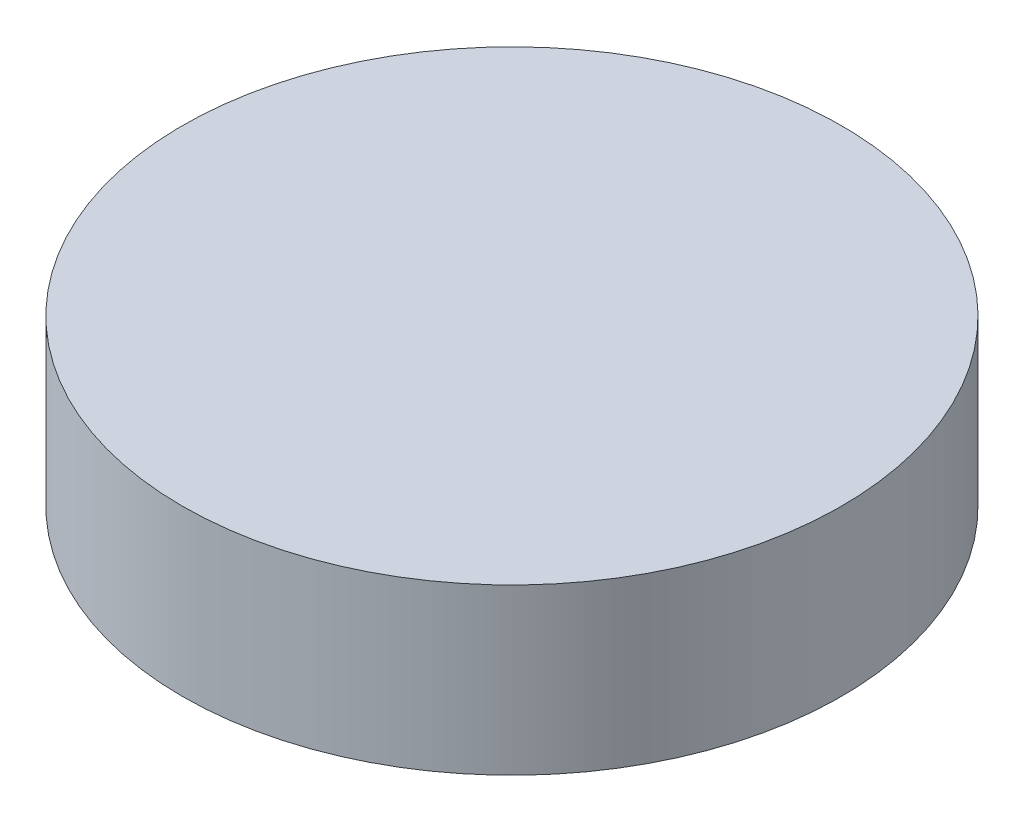
ISO-10303-21;
HEADER;
FILE_DESCRIPTION(('STEP AP214'),'2;1');
FILE_NAME('part.step','',(''),(''),'','','');
FILE_SCHEMA(('AUTOMOTIVE_DESIGN { 1 0 10303 214 1 1 1 1 }'));
ENDSEC;
DATA;
#1=APPLICATION_CONTEXT('core data for automotive mechanical design processes');
#2=APPLICATION_PROTOCOL_DEFINITION('international standard','automotive_design',2000,#1);
#3=PRODUCT_CONTEXT('',#1,'mechanical');
#4=PRODUCT('Part','Part','',(#3));
#5=PRODUCT_RELATED_PRODUCT_CATEGORY('part','',(#4));
#6=PRODUCT_DEFINITION_FORMATION('','',#4);
#7=PRODUCT_DEFINITION_CONTEXT('part definition',#1,'design');
#8=PRODUCT_DEFINITION('design','',#6,#7);
#9=PRODUCT_DEFINITION_SHAPE('','',#8);
#10=(LENGTH_UNIT() NAMED_UNIT(*) SI_UNIT(.MILLI.,.METRE.));
#11=(NAMED_UNIT(*) PLANE_ANGLE_UNIT() SI_UNIT($,.RADIAN.));
#12=(NAMED_UNIT(*) SI_UNIT($,.STERADIAN.) SOLID_ANGLE_UNIT());
#13=UNCERTAINTY_MEASURE_WITH_UNIT(LENGTH_MEASURE(1.E-05),#10,'distance_accuracy_value','');
#14=(GEOMETRIC_REPRESENTATION_CONTEXT(3) GLOBAL_UNCERTAINTY_ASSIGNED_CONTEXT((#13)) GLOBAL_UNIT_ASSIGNED_CONTEXT((#10,
#11,#12)) REPRESENTATION_CONTEXT('',''));
#15=CARTESIAN_POINT('',(0.,0.,0.));
#16=DIRECTION('',(0.,0.,1.));
#17=DIRECTION('',(1.,0.,0.));
#18=AXIS2_PLACEMENT_3D('',#15,#16,#17);
#19=CARTESIAN_POINT('',(0.,6.35,0.));
#20=DIRECTION('',(0.,-1.,0.));
#21=DIRECTION('',(0.,0.,-1.));
#22=AXIS2_PLACEMENT_3D('',#19,#20,#21);
#23=CYLINDRICAL_SURFACE('',#22,25.4);
#24=CARTESIAN_POINT('',(0.,6.35,0.));
#25=DIRECTION('',(0.,1.,0.));
#26=DIRECTION('',(0.,0.,1.));
#27=AXIS2_PLACEMENT_3D('',#24,#25,#26);
#28=CIRCLE('',#27,25.4);
#29=CARTESIAN_POINT('',(0.,6.35,25.4));
#30=VERTEX_POINT('',#29);
#31=EDGE_CURVE('E10',#30,#30,#28,.T.);
#32=ORIENTED_EDGE('',*,*,#31,.F.);
#33=EDGE_LOOP('',(#32));
#34=FACE_BOUND('',#33,.T.);
#35=CARTESIAN_POINT('',(0.,-6.35,0.));
#36=DIRECTION('',(0.,1.,0.));
#37=DIRECTION('',(0.,0.,1.));
#38=AXIS2_PLACEMENT_3D('',#35,#36,#37);
#39=CIRCLE('',#38,25.4);
#40=CARTESIAN_POINT('',(0.,-6.35,25.4));
#41=VERTEX_POINT('',#40);
#42=EDGE_CURVE('E33',#41,#41,#39,.T.);
#43=ORIENTED_EDGE('',*,*,#42,.T.);
#44=EDGE_LOOP('',(#43));
#45=FACE_BOUND('',#44,.T.);
#46=ADVANCED_FACE('F30',(#34,#45),#23,.T.);
#47=CARTESIAN_POINT('',(0.,6.35,0.));
#48=DIRECTION('',(0.,1.,0.));
#49=DIRECTION('',(0.,0.,1.));
#50=AXIS2_PLACEMENT_3D('',#47,#48,#49);
#51=PLANE('',#50);
#52=ORIENTED_EDGE('',*,*,#31,.T.);
#53=EDGE_LOOP('',(#52));
#54=FACE_BOUND('',#53,.T.);
#55=ADVANCED_FACE('F45',(#54),#51,.T.);
#56=CARTESIAN_POINT('',(0.,-6.35,0.));
#57=DIRECTION('',(0.,1.,0.));
#58=DIRECTION('',(0.,0.,1.));
#59=AXIS2_PLACEMENT_3D('',#56,#57,#58);
#60=PLANE('',#59);
#61=ORIENTED_EDGE('',*,*,#42,.F.);
#62=EDGE_LOOP('',(#61));
#63=FACE_BOUND('',#62,.T.);
#64=ADVANCED_FACE('F43',(#63),#60,.F.);
#65=CLOSED_SHELL('',(#46,#55,#64));
#66=MANIFOLD_SOLID_BREP('B2',#65);
#67=ADVANCED_BREP_SHAPE_REPRESENTATION('',(#18,#66),#14);
#68=SHAPE_DEFINITION_REPRESENTATION(#9,#67);
ENDSEC;
END-ISO-10303-21;
